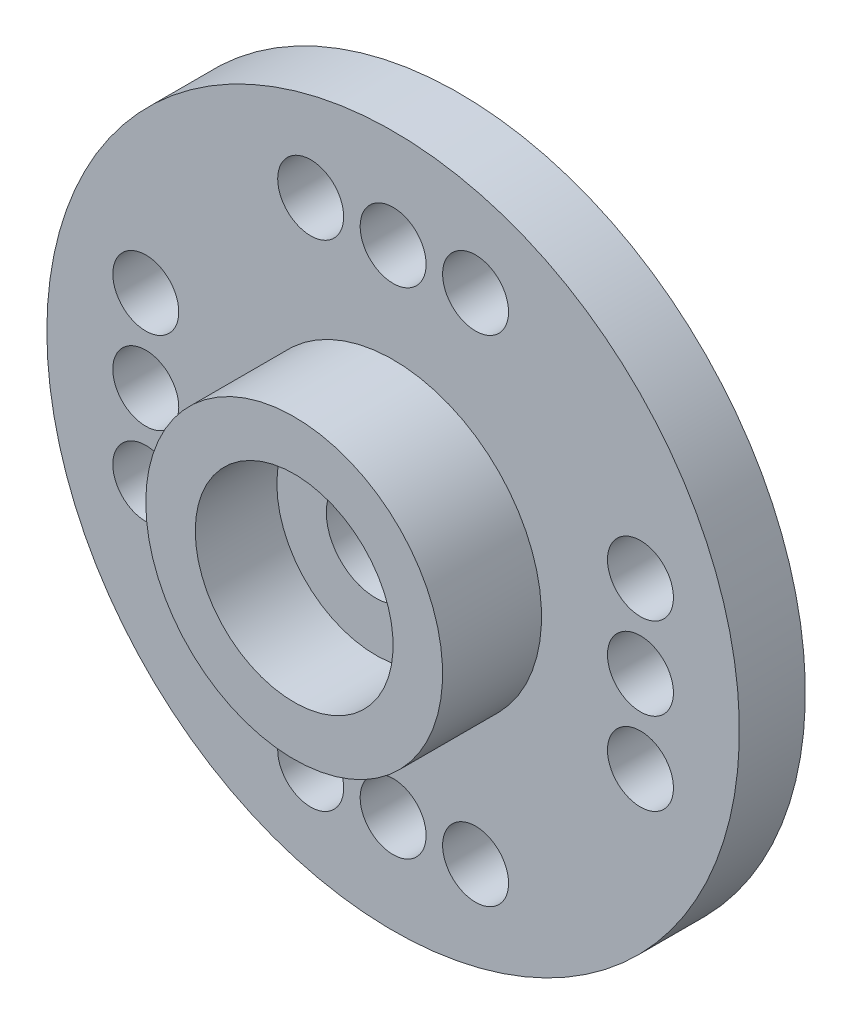
ISO-10303-21;
HEADER;
FILE_DESCRIPTION(('STEP AP214'),'2;1');
FILE_NAME('part.step','',(''),(''),'','','');
FILE_SCHEMA(('AUTOMOTIVE_DESIGN { 1 0 10303 214 1 1 1 1 }'));
ENDSEC;
DATA;
#1=APPLICATION_CONTEXT('core data for automotive mechanical design processes');
#2=APPLICATION_PROTOCOL_DEFINITION('international standard','automotive_design',2000,#1);
#3=PRODUCT_CONTEXT('',#1,'mechanical');
#4=PRODUCT('Part','Part','',(#3));
#5=PRODUCT_RELATED_PRODUCT_CATEGORY('part','',(#4));
#6=PRODUCT_DEFINITION_FORMATION('','',#4);
#7=PRODUCT_DEFINITION_CONTEXT('part definition',#1,'design');
#8=PRODUCT_DEFINITION('design','',#6,#7);
#9=PRODUCT_DEFINITION_SHAPE('','',#8);
#10=(LENGTH_UNIT() NAMED_UNIT(*) SI_UNIT(.MILLI.,.METRE.));
#11=(NAMED_UNIT(*) PLANE_ANGLE_UNIT() SI_UNIT($,.RADIAN.));
#12=(NAMED_UNIT(*) SI_UNIT($,.STERADIAN.) SOLID_ANGLE_UNIT());
#13=UNCERTAINTY_MEASURE_WITH_UNIT(LENGTH_MEASURE(1.E-05),#10,'distance_accuracy_value','');
#14=(GEOMETRIC_REPRESENTATION_CONTEXT(3) GLOBAL_UNCERTAINTY_ASSIGNED_CONTEXT((#13)) GLOBAL_UNIT_ASSIGNED_CONTEXT((#10,
#11,#12)) REPRESENTATION_CONTEXT('',''));
#15=CARTESIAN_POINT('',(0.,0.,0.));
#16=DIRECTION('',(0.,0.,1.));
#17=DIRECTION('',(1.,0.,0.));
#18=AXIS2_PLACEMENT_3D('',#15,#16,#17);
#19=CARTESIAN_POINT('',(0.,0.,0.));
#20=DIRECTION('',(0.,0.,-1.));
#21=DIRECTION('',(-1.,0.,0.));
#22=AXIS2_PLACEMENT_3D('',#19,#20,#21);
#23=CYLINDRICAL_SURFACE('',#22,1.5);
#24=CARTESIAN_POINT('',(0.,0.,0.));
#25=DIRECTION('',(0.,0.,-1.));
#26=DIRECTION('',(-1.,0.,0.));
#27=AXIS2_PLACEMENT_3D('',#24,#25,#26);
#28=CIRCLE('',#27,1.5);
#29=CARTESIAN_POINT('',(-1.5,0.,0.));
#30=VERTEX_POINT('',#29);
#31=EDGE_CURVE('E10',#30,#30,#28,.T.);
#32=ORIENTED_EDGE('',*,*,#31,.T.);
#33=EDGE_LOOP('',(#32));
#34=FACE_BOUND('',#33,.T.);
#35=CARTESIAN_POINT('',(0.,0.,1.52553869697731));
#36=DIRECTION('',(0.,0.,-1.));
#37=DIRECTION('',(-1.,0.,0.));
#38=AXIS2_PLACEMENT_3D('',#35,#36,#37);
#39=CIRCLE('',#38,1.5);
#40=CARTESIAN_POINT('',(-1.5,0.,1.52553869697731));
#41=VERTEX_POINT('',#40);
#42=EDGE_CURVE('E49',#41,#41,#39,.T.);
#43=ORIENTED_EDGE('',*,*,#42,.F.);
#44=EDGE_LOOP('',(#43));
#45=FACE_BOUND('',#44,.T.);
#46=ADVANCED_FACE('F30',(#34,#45),#23,.F.);
#47=CARTESIAN_POINT('',(0.,1.5,0.));
#48=DIRECTION('',(0.,0.,-1.));
#49=DIRECTION('',(-1.,0.,0.));
#50=AXIS2_PLACEMENT_3D('',#47,#48,#49);
#51=PLANE('',#50);
#52=CARTESIAN_POINT('',(0.,0.,0.));
#53=DIRECTION('',(0.,0.,-1.));
#54=DIRECTION('',(-1.,0.,0.));
#55=AXIS2_PLACEMENT_3D('',#52,#53,#54);
#56=CIRCLE('',#55,3.);
#57=CARTESIAN_POINT('',(-3.,0.,0.));
#58=VERTEX_POINT('',#57);
#59=EDGE_CURVE('E37',#58,#58,#56,.T.);
#60=ORIENTED_EDGE('',*,*,#59,.T.);
#61=EDGE_LOOP('',(#60));
#62=FACE_BOUND('',#61,.T.);
#63=ORIENTED_EDGE('',*,*,#31,.F.);
#64=EDGE_LOOP('',(#63));
#65=FACE_BOUND('',#64,.T.);
#66=ADVANCED_FACE('F168',(#62,#65),#51,.T.);
#67=CARTESIAN_POINT('',(0.,0.,0.));
#68=DIRECTION('',(0.,0.,-1.));
#69=DIRECTION('',(-1.,0.,0.));
#70=AXIS2_PLACEMENT_3D('',#67,#68,#69);
#71=CYLINDRICAL_SURFACE('',#70,3.);
#72=CARTESIAN_POINT('',(0.,0.,-1.5));
#73=DIRECTION('',(0.,0.,-1.));
#74=DIRECTION('',(-1.,0.,0.));
#75=AXIS2_PLACEMENT_3D('',#72,#73,#74);
#76=CIRCLE('',#75,3.);
#77=CARTESIAN_POINT('',(-3.,0.,-1.5));
#78=VERTEX_POINT('',#77);
#79=EDGE_CURVE('E42',#78,#78,#76,.T.);
#80=ORIENTED_EDGE('',*,*,#79,.T.);
#81=EDGE_LOOP('',(#80));
#82=FACE_BOUND('',#81,.T.);
#83=ORIENTED_EDGE('',*,*,#59,.F.);
#84=EDGE_LOOP('',(#83));
#85=FACE_BOUND('',#84,.T.);
#86=ADVANCED_FACE('F153',(#82,#85),#71,.F.);
#87=CARTESIAN_POINT('',(0.,3.,-1.5));
#88=DIRECTION('',(0.,0.,-1.));
#89=DIRECTION('',(-1.,0.,0.));
#90=AXIS2_PLACEMENT_3D('',#87,#88,#89);
#91=PLANE('',#90);
#92=CARTESIAN_POINT('',(0.,0.,-1.5));
#93=DIRECTION('',(0.,0.,-1.));
#94=DIRECTION('',(-1.,0.,0.));
#95=AXIS2_PLACEMENT_3D('',#92,#93,#94);
#96=CIRCLE('',#95,3.5);
#97=CARTESIAN_POINT('',(-3.5,0.,-1.5));
#98=VERTEX_POINT('',#97);
#99=EDGE_CURVE('E148',#98,#98,#96,.T.);
#100=ORIENTED_EDGE('',*,*,#99,.T.);
#101=EDGE_LOOP('',(#100));
#102=FACE_BOUND('',#101,.T.);
#103=ORIENTED_EDGE('',*,*,#79,.F.);
#104=EDGE_LOOP('',(#103));
#105=FACE_BOUND('',#104,.T.);
#106=ADVANCED_FACE('F156',(#102,#105),#91,.T.);
#107=CARTESIAN_POINT('',(0.,0.,0.));
#108=DIRECTION('',(0.,0.,-1.));
#109=DIRECTION('',(-1.,0.,0.));
#110=AXIS2_PLACEMENT_3D('',#107,#108,#109);
#111=CYLINDRICAL_SURFACE('',#110,3.5);
#112=CARTESIAN_POINT('',(0.,0.,0.5));
#113=DIRECTION('',(0.,0.,-1.));
#114=DIRECTION('',(-1.,0.,0.));
#115=AXIS2_PLACEMENT_3D('',#112,#113,#114);
#116=CIRCLE('',#115,3.5);
#117=CARTESIAN_POINT('',(-3.5,0.,0.5));
#118=VERTEX_POINT('',#117);
#119=EDGE_CURVE('E145',#118,#118,#116,.T.);
#120=ORIENTED_EDGE('',*,*,#119,.T.);
#121=EDGE_LOOP('',(#120));
#122=FACE_BOUND('',#121,.T.);
#123=ORIENTED_EDGE('',*,*,#99,.F.);
#124=EDGE_LOOP('',(#123));
#125=FACE_BOUND('',#124,.T.);
#126=ADVANCED_FACE('F158',(#122,#125),#111,.T.);
#127=CARTESIAN_POINT('',(0.,3.5,0.5));
#128=DIRECTION('',(0.,0.,-1.));
#129=DIRECTION('',(-1.,0.,0.));
#130=AXIS2_PLACEMENT_3D('',#127,#128,#129);
#131=PLANE('',#130);
#132=CARTESIAN_POINT('',(0.,0.,0.5));
#133=DIRECTION('',(0.,0.,-1.));
#134=DIRECTION('',(-1.,0.,0.));
#135=AXIS2_PLACEMENT_3D('',#132,#133,#134);
#136=CIRCLE('',#135,4.5);
#137=CARTESIAN_POINT('',(-4.5,0.,0.5));
#138=VERTEX_POINT('',#137);
#139=EDGE_CURVE('E142',#138,#138,#136,.T.);
#140=ORIENTED_EDGE('',*,*,#139,.T.);
#141=EDGE_LOOP('',(#140));
#142=FACE_BOUND('',#141,.T.);
#143=ORIENTED_EDGE('',*,*,#119,.F.);
#144=EDGE_LOOP('',(#143));
#145=FACE_BOUND('',#144,.T.);
#146=ADVANCED_FACE('F165',(#142,#145),#131,.T.);
#147=CARTESIAN_POINT('',(0.,0.,0.));
#148=DIRECTION('',(0.,0.,-1.));
#149=DIRECTION('',(-1.,0.,0.));
#150=AXIS2_PLACEMENT_3D('',#147,#148,#149);
#151=CYLINDRICAL_SURFACE('',#150,4.5);
#152=CARTESIAN_POINT('',(0.,0.,-1.));
#153=DIRECTION('',(0.,0.,-1.));
#154=DIRECTION('',(-1.,0.,0.));
#155=AXIS2_PLACEMENT_3D('',#152,#153,#154);
#156=CIRCLE('',#155,4.5);
#157=CARTESIAN_POINT('',(-4.5,0.,-1.));
#158=VERTEX_POINT('',#157);
#159=EDGE_CURVE('E139',#158,#158,#156,.T.);
#160=ORIENTED_EDGE('',*,*,#159,.T.);
#161=EDGE_LOOP('',(#160));
#162=FACE_BOUND('',#161,.T.);
#163=ORIENTED_EDGE('',*,*,#139,.F.);
#164=EDGE_LOOP('',(#163));
#165=FACE_BOUND('',#164,.T.);
#166=ADVANCED_FACE('F219',(#162,#165),#151,.F.);
#167=CARTESIAN_POINT('',(0.,4.5,-1.));
#168=DIRECTION('',(0.,0.,-1.));
#169=DIRECTION('',(-1.,0.,0.));
#170=AXIS2_PLACEMENT_3D('',#167,#168,#169);
#171=PLANE('',#170);
#172=CARTESIAN_POINT('',(-2.50000000000008,7.49999999999997,-1.));
#173=DIRECTION('',(0.,0.,-1.));
#174=DIRECTION('',(-1.,0.,0.));
#175=AXIS2_PLACEMENT_3D('',#172,#173,#174);
#176=CIRCLE('',#175,1.);
#177=CARTESIAN_POINT('',(-3.50000000000008,7.49999999999997,-1.));
#178=VERTEX_POINT('',#177);
#179=EDGE_CURVE('E98',#178,#178,#176,.T.);
#180=ORIENTED_EDGE('',*,*,#179,.F.);
#181=EDGE_LOOP('',(#180));
#182=FACE_BOUND('',#181,.T.);
#183=CARTESIAN_POINT('',(7.49999999999998,2.50000000000005,-1.));
#184=DIRECTION('',(0.,0.,-1.));
#185=DIRECTION('',(-1.,0.,0.));
#186=AXIS2_PLACEMENT_3D('',#183,#184,#185);
#187=CIRCLE('',#186,1.);
#188=CARTESIAN_POINT('',(6.49999999999998,2.50000000000005,-1.));
#189=VERTEX_POINT('',#188);
#190=EDGE_CURVE('E88',#189,#189,#187,.T.);
#191=ORIENTED_EDGE('',*,*,#190,.F.);
#192=EDGE_LOOP('',(#191));
#193=FACE_BOUND('',#192,.T.);
#194=CARTESIAN_POINT('',(2.50000000000003,-7.49999999999999,-1.));
#195=DIRECTION('',(0.,0.,-1.));
#196=DIRECTION('',(-1.,0.,0.));
#197=AXIS2_PLACEMENT_3D('',#194,#195,#196);
#198=CIRCLE('',#197,1.);
#199=CARTESIAN_POINT('',(1.50000000000003,-7.49999999999999,-1.));
#200=VERTEX_POINT('',#199);
#201=EDGE_CURVE('E85',#200,#200,#198,.T.);
#202=ORIENTED_EDGE('',*,*,#201,.F.);
#203=EDGE_LOOP('',(#202));
#204=FACE_BOUND('',#203,.T.);
#205=CARTESIAN_POINT('',(2.50000000000014,7.49999999999972,-1.));
#206=DIRECTION('',(0.,0.,-1.));
#207=DIRECTION('',(-1.,0.,0.));
#208=AXIS2_PLACEMENT_3D('',#205,#206,#207);
#209=CIRCLE('',#208,1.);
#210=CARTESIAN_POINT('',(1.50000000000014,7.49999999999972,-1.));
#211=VERTEX_POINT('',#210);
#212=EDGE_CURVE('E82',#211,#211,#209,.T.);
#213=ORIENTED_EDGE('',*,*,#212,.F.);
#214=EDGE_LOOP('',(#213));
#215=FACE_BOUND('',#214,.T.);
#216=CARTESIAN_POINT('',(7.49999999999986,-2.50000000000042,-1.));
#217=DIRECTION('',(0.,0.,-1.));
#218=DIRECTION('',(-1.,0.,0.));
#219=AXIS2_PLACEMENT_3D('',#216,#217,#218);
#220=CIRCLE('',#219,1.);
#221=CARTESIAN_POINT('',(6.49999999999986,-2.50000000000042,-1.));
#222=VERTEX_POINT('',#221);
#223=EDGE_CURVE('E78',#222,#222,#220,.T.);
#224=ORIENTED_EDGE('',*,*,#223,.F.);
#225=EDGE_LOOP('',(#224));
#226=FACE_BOUND('',#225,.T.);
#227=CARTESIAN_POINT('',(-2.50000000000028,-7.50000000000014,-1.));
#228=DIRECTION('',(0.,0.,-1.));
#229=DIRECTION('',(-1.,0.,0.));
#230=AXIS2_PLACEMENT_3D('',#227,#228,#229);
#231=CIRCLE('',#230,1.);
#232=CARTESIAN_POINT('',(-3.50000000000028,-7.50000000000014,-1.));
#233=VERTEX_POINT('',#232);
#234=EDGE_CURVE('E74',#233,#233,#231,.T.);
#235=ORIENTED_EDGE('',*,*,#234,.F.);
#236=EDGE_LOOP('',(#235));
#237=FACE_BOUND('',#236,.T.);
#238=CARTESIAN_POINT('',(0.,-7.5,-1.));
#239=DIRECTION('',(0.,0.,-1.));
#240=DIRECTION('',(-1.,0.,0.));
#241=AXIS2_PLACEMENT_3D('',#238,#239,#240);
#242=CIRCLE('',#241,1.);
#243=CARTESIAN_POINT('',(-1.,-7.5,-1.));
#244=VERTEX_POINT('',#243);
#245=EDGE_CURVE('E70',#244,#244,#242,.T.);
#246=ORIENTED_EDGE('',*,*,#245,.F.);
#247=EDGE_LOOP('',(#246));
#248=FACE_BOUND('',#247,.T.);
#249=CARTESIAN_POINT('',(7.5,0.,-1.));
#250=DIRECTION('',(0.,0.,-1.));
#251=DIRECTION('',(-1.,0.,0.));
#252=AXIS2_PLACEMENT_3D('',#249,#250,#251);
#253=CIRCLE('',#252,1.);
#254=CARTESIAN_POINT('',(6.5,0.,-1.));
#255=VERTEX_POINT('',#254);
#256=EDGE_CURVE('E66',#255,#255,#253,.T.);
#257=ORIENTED_EDGE('',*,*,#256,.F.);
#258=EDGE_LOOP('',(#257));
#259=FACE_BOUND('',#258,.T.);
#260=CARTESIAN_POINT('',(-7.5,0.,-1.));
#261=DIRECTION('',(0.,0.,-1.));
#262=DIRECTION('',(-1.,0.,0.));
#263=AXIS2_PLACEMENT_3D('',#260,#261,#262);
#264=CIRCLE('',#263,1.);
#265=CARTESIAN_POINT('',(-8.5,0.,-1.));
#266=VERTEX_POINT('',#265);
#267=EDGE_CURVE('E62',#266,#266,#264,.T.);
#268=ORIENTED_EDGE('',*,*,#267,.F.);
#269=EDGE_LOOP('',(#268));
#270=FACE_BOUND('',#269,.T.);
#271=CARTESIAN_POINT('',(0.,7.5,-1.));
#272=DIRECTION('',(0.,0.,-1.));
#273=DIRECTION('',(-1.,0.,0.));
#274=AXIS2_PLACEMENT_3D('',#271,#272,#273);
#275=CIRCLE('',#274,1.);
#276=CARTESIAN_POINT('',(-1.,7.5,-1.));
#277=VERTEX_POINT('',#276);
#278=EDGE_CURVE('E58',#277,#277,#275,.T.);
#279=ORIENTED_EDGE('',*,*,#278,.F.);
#280=EDGE_LOOP('',(#279));
#281=FACE_BOUND('',#280,.T.);
#282=CARTESIAN_POINT('',(-7.5,-2.5,-1.));
#283=DIRECTION('',(0.,0.,-1.));
#284=DIRECTION('',(-1.,0.,0.));
#285=AXIS2_PLACEMENT_3D('',#282,#283,#284);
#286=CIRCLE('',#285,1.);
#287=CARTESIAN_POINT('',(-8.5,-2.5,-1.));
#288=VERTEX_POINT('',#287);
#289=EDGE_CURVE('E54',#288,#288,#286,.T.);
#290=ORIENTED_EDGE('',*,*,#289,.F.);
#291=EDGE_LOOP('',(#290));
#292=FACE_BOUND('',#291,.T.);
#293=CARTESIAN_POINT('',(-7.5,2.5,-1.));
#294=DIRECTION('',(0.,0.,-1.));
#295=DIRECTION('',(-1.,0.,0.));
#296=AXIS2_PLACEMENT_3D('',#293,#294,#295);
#297=CIRCLE('',#296,1.);
#298=CARTESIAN_POINT('',(-8.5,2.5,-1.));
#299=VERTEX_POINT('',#298);
#300=EDGE_CURVE('E50',#299,#299,#297,.T.);
#301=ORIENTED_EDGE('',*,*,#300,.F.);
#302=EDGE_LOOP('',(#301));
#303=FACE_BOUND('',#302,.T.);
#304=CARTESIAN_POINT('',(0.,0.,-1.));
#305=DIRECTION('',(0.,0.,-1.));
#306=DIRECTION('',(-1.,0.,0.));
#307=AXIS2_PLACEMENT_3D('',#304,#305,#306);
#308=CIRCLE('',#307,10.5);
#309=CARTESIAN_POINT('',(-10.5,0.,-1.));
#310=VERTEX_POINT('',#309);
#311=EDGE_CURVE('E136',#310,#310,#308,.T.);
#312=ORIENTED_EDGE('',*,*,#311,.T.);
#313=EDGE_LOOP('',(#312));
#314=FACE_BOUND('',#313,.T.);
#315=ORIENTED_EDGE('',*,*,#159,.F.);
#316=EDGE_LOOP('',(#315));
#317=FACE_BOUND('',#316,.T.);
#318=ADVANCED_FACE('F213',(#182,#193,#204,#215,#226,#237,#248,#259,#270,#281,#292,#303,#314,
#317),#171,.T.);
#319=CARTESIAN_POINT('',(0.,0.,0.));
#320=DIRECTION('',(0.,0.,-1.));
#321=DIRECTION('',(-1.,0.,0.));
#322=AXIS2_PLACEMENT_3D('',#319,#320,#321);
#323=CYLINDRICAL_SURFACE('',#322,10.5);
#324=CARTESIAN_POINT('',(0.,0.,1.));
#325=DIRECTION('',(0.,0.,-1.));
#326=DIRECTION('',(-1.,0.,0.));
#327=AXIS2_PLACEMENT_3D('',#324,#325,#326);
#328=CIRCLE('',#327,10.5);
#329=CARTESIAN_POINT('',(-10.5,0.,1.));
#330=VERTEX_POINT('',#329);
#331=EDGE_CURVE('E133',#330,#330,#328,.T.);
#332=ORIENTED_EDGE('',*,*,#331,.T.);
#333=EDGE_LOOP('',(#332));
#334=FACE_BOUND('',#333,.T.);
#335=ORIENTED_EDGE('',*,*,#311,.F.);
#336=EDGE_LOOP('',(#335));
#337=FACE_BOUND('',#336,.T.);
#338=ADVANCED_FACE('F206',(#334,#337),#323,.T.);
#339=CARTESIAN_POINT('',(0.,10.5,1.));
#340=DIRECTION('',(0.,0.,1.));
#341=DIRECTION('',(1.,0.,0.));
#342=AXIS2_PLACEMENT_3D('',#339,#340,#341);
#343=PLANE('',#342);
#344=CARTESIAN_POINT('',(-2.50000000000008,7.49999999999997,1.));
#345=DIRECTION('',(0.,0.,1.));
#346=DIRECTION('',(1.,0.,0.));
#347=AXIS2_PLACEMENT_3D('',#344,#345,#346);
#348=CIRCLE('',#347,1.);
#349=CARTESIAN_POINT('',(-1.50000000000008,7.49999999999997,1.));
#350=VERTEX_POINT('',#349);
#351=EDGE_CURVE('E33',#350,#350,#348,.T.);
#352=ORIENTED_EDGE('',*,*,#351,.F.);
#353=EDGE_LOOP('',(#352));
#354=FACE_BOUND('',#353,.T.);
#355=CARTESIAN_POINT('',(7.49999999999998,2.50000000000005,1.));
#356=DIRECTION('',(0.,0.,1.));
#357=DIRECTION('',(1.,0.,0.));
#358=AXIS2_PLACEMENT_3D('',#355,#356,#357);
#359=CIRCLE('',#358,1.);
#360=CARTESIAN_POINT('',(8.49999999999998,2.50000000000005,1.));
#361=VERTEX_POINT('',#360);
#362=EDGE_CURVE('E86',#361,#361,#359,.T.);
#363=ORIENTED_EDGE('',*,*,#362,.F.);
#364=EDGE_LOOP('',(#363));
#365=FACE_BOUND('',#364,.T.);
#366=CARTESIAN_POINT('',(2.50000000000003,-7.49999999999999,1.));
#367=DIRECTION('',(0.,0.,1.));
#368=DIRECTION('',(1.,0.,0.));
#369=AXIS2_PLACEMENT_3D('',#366,#367,#368);
#370=CIRCLE('',#369,1.);
#371=CARTESIAN_POINT('',(3.50000000000003,-7.49999999999999,1.));
#372=VERTEX_POINT('',#371);
#373=EDGE_CURVE('E83',#372,#372,#370,.T.);
#374=ORIENTED_EDGE('',*,*,#373,.F.);
#375=EDGE_LOOP('',(#374));
#376=FACE_BOUND('',#375,.T.);
#377=CARTESIAN_POINT('',(2.50000000000014,7.49999999999972,1.));
#378=DIRECTION('',(0.,0.,1.));
#379=DIRECTION('',(1.,0.,0.));
#380=AXIS2_PLACEMENT_3D('',#377,#378,#379);
#381=CIRCLE('',#380,1.);
#382=CARTESIAN_POINT('',(3.50000000000014,7.49999999999972,1.));
#383=VERTEX_POINT('',#382);
#384=EDGE_CURVE('E79',#383,#383,#381,.T.);
#385=ORIENTED_EDGE('',*,*,#384,.F.);
#386=EDGE_LOOP('',(#385));
#387=FACE_BOUND('',#386,.T.);
#388=CARTESIAN_POINT('',(7.49999999999986,-2.50000000000042,1.));
#389=DIRECTION('',(0.,0.,1.));
#390=DIRECTION('',(1.,0.,0.));
#391=AXIS2_PLACEMENT_3D('',#388,#389,#390);
#392=CIRCLE('',#391,1.);
#393=CARTESIAN_POINT('',(8.49999999999986,-2.50000000000042,1.));
#394=VERTEX_POINT('',#393);
#395=EDGE_CURVE('E75',#394,#394,#392,.T.);
#396=ORIENTED_EDGE('',*,*,#395,.F.);
#397=EDGE_LOOP('',(#396));
#398=FACE_BOUND('',#397,.T.);
#399=CARTESIAN_POINT('',(-2.50000000000028,-7.50000000000014,1.));
#400=DIRECTION('',(0.,0.,1.));
#401=DIRECTION('',(1.,0.,0.));
#402=AXIS2_PLACEMENT_3D('',#399,#400,#401);
#403=CIRCLE('',#402,1.);
#404=CARTESIAN_POINT('',(-1.50000000000028,-7.50000000000014,1.));
#405=VERTEX_POINT('',#404);
#406=EDGE_CURVE('E71',#405,#405,#403,.T.);
#407=ORIENTED_EDGE('',*,*,#406,.F.);
#408=EDGE_LOOP('',(#407));
#409=FACE_BOUND('',#408,.T.);
#410=CARTESIAN_POINT('',(0.,-7.5,1.));
#411=DIRECTION('',(0.,0.,1.));
#412=DIRECTION('',(1.,0.,0.));
#413=AXIS2_PLACEMENT_3D('',#410,#411,#412);
#414=CIRCLE('',#413,1.);
#415=CARTESIAN_POINT('',(1.,-7.5,1.));
#416=VERTEX_POINT('',#415);
#417=EDGE_CURVE('E67',#416,#416,#414,.T.);
#418=ORIENTED_EDGE('',*,*,#417,.F.);
#419=EDGE_LOOP('',(#418));
#420=FACE_BOUND('',#419,.T.);
#421=CARTESIAN_POINT('',(7.5,0.,1.));
#422=DIRECTION('',(0.,0.,1.));
#423=DIRECTION('',(1.,0.,0.));
#424=AXIS2_PLACEMENT_3D('',#421,#422,#423);
#425=CIRCLE('',#424,1.);
#426=CARTESIAN_POINT('',(8.5,0.,1.));
#427=VERTEX_POINT('',#426);
#428=EDGE_CURVE('E63',#427,#427,#425,.T.);
#429=ORIENTED_EDGE('',*,*,#428,.F.);
#430=EDGE_LOOP('',(#429));
#431=FACE_BOUND('',#430,.T.);
#432=CARTESIAN_POINT('',(-7.5,0.,1.));
#433=DIRECTION('',(0.,0.,1.));
#434=DIRECTION('',(1.,0.,0.));
#435=AXIS2_PLACEMENT_3D('',#432,#433,#434);
#436=CIRCLE('',#435,1.);
#437=CARTESIAN_POINT('',(-6.5,0.,1.));
#438=VERTEX_POINT('',#437);
#439=EDGE_CURVE('E59',#438,#438,#436,.T.);
#440=ORIENTED_EDGE('',*,*,#439,.F.);
#441=EDGE_LOOP('',(#440));
#442=FACE_BOUND('',#441,.T.);
#443=CARTESIAN_POINT('',(0.,7.5,1.));
#444=DIRECTION('',(0.,0.,1.));
#445=DIRECTION('',(1.,0.,0.));
#446=AXIS2_PLACEMENT_3D('',#443,#444,#445);
#447=CIRCLE('',#446,1.);
#448=CARTESIAN_POINT('',(1.,7.5,1.));
#449=VERTEX_POINT('',#448);
#450=EDGE_CURVE('E55',#449,#449,#447,.T.);
#451=ORIENTED_EDGE('',*,*,#450,.F.);
#452=EDGE_LOOP('',(#451));
#453=FACE_BOUND('',#452,.T.);
#454=CARTESIAN_POINT('',(-7.5,-2.5,1.));
#455=DIRECTION('',(0.,0.,1.));
#456=DIRECTION('',(1.,0.,0.));
#457=AXIS2_PLACEMENT_3D('',#454,#455,#456);
#458=CIRCLE('',#457,1.);
#459=CARTESIAN_POINT('',(-6.5,-2.5,1.));
#460=VERTEX_POINT('',#459);
#461=EDGE_CURVE('E51',#460,#460,#458,.T.);
#462=ORIENTED_EDGE('',*,*,#461,.F.);
#463=EDGE_LOOP('',(#462));
#464=FACE_BOUND('',#463,.T.);
#465=CARTESIAN_POINT('',(-7.5,2.5,1.));
#466=DIRECTION('',(0.,0.,1.));
#467=DIRECTION('',(1.,0.,0.));
#468=AXIS2_PLACEMENT_3D('',#465,#466,#467);
#469=CIRCLE('',#468,1.);
#470=CARTESIAN_POINT('',(-6.5,2.5,1.));
#471=VERTEX_POINT('',#470);
#472=EDGE_CURVE('E46',#471,#471,#469,.T.);
#473=ORIENTED_EDGE('',*,*,#472,.F.);
#474=EDGE_LOOP('',(#473));
#475=FACE_BOUND('',#474,.T.);
#476=CARTESIAN_POINT('',(0.,0.,0.999999999999999));
#477=DIRECTION('',(0.,0.,-1.));
#478=DIRECTION('',(-1.,0.,0.));
#479=AXIS2_PLACEMENT_3D('',#476,#477,#478);
#480=CIRCLE('',#479,4.5);
#481=CARTESIAN_POINT('',(-4.5,0.,0.999999999999999));
#482=VERTEX_POINT('',#481);
#483=EDGE_CURVE('E130',#482,#482,#480,.T.);
#484=ORIENTED_EDGE('',*,*,#483,.T.);
#485=EDGE_LOOP('',(#484));
#486=FACE_BOUND('',#485,.T.);
#487=ORIENTED_EDGE('',*,*,#331,.F.);
#488=EDGE_LOOP('',(#487));
#489=FACE_BOUND('',#488,.T.);
#490=ADVANCED_FACE('F200',(#354,#365,#376,#387,#398,#409,#420,#431,#442,#453,#464,#475,#486,
#489),#343,.T.);
#491=CARTESIAN_POINT('',(0.,0.,0.));
#492=DIRECTION('',(0.,0.,-1.));
#493=DIRECTION('',(-1.,0.,0.));
#494=AXIS2_PLACEMENT_3D('',#491,#492,#493);
#495=CYLINDRICAL_SURFACE('',#494,4.5);
#496=CARTESIAN_POINT('',(0.,0.,4.));
#497=DIRECTION('',(0.,0.,-1.));
#498=DIRECTION('',(-1.,0.,0.));
#499=AXIS2_PLACEMENT_3D('',#496,#497,#498);
#500=CIRCLE('',#499,4.5);
#501=CARTESIAN_POINT('',(-4.5,0.,4.));
#502=VERTEX_POINT('',#501);
#503=EDGE_CURVE('E127',#502,#502,#500,.T.);
#504=ORIENTED_EDGE('',*,*,#503,.T.);
#505=EDGE_LOOP('',(#504));
#506=FACE_BOUND('',#505,.T.);
#507=ORIENTED_EDGE('',*,*,#483,.F.);
#508=EDGE_LOOP('',(#507));
#509=FACE_BOUND('',#508,.T.);
#510=ADVANCED_FACE('F194',(#506,#509),#495,.T.);
#511=CARTESIAN_POINT('',(0.,4.5,4.));
#512=DIRECTION('',(0.,0.,1.));
#513=DIRECTION('',(1.,0.,0.));
#514=AXIS2_PLACEMENT_3D('',#511,#512,#513);
#515=PLANE('',#514);
#516=CARTESIAN_POINT('',(0.,0.,4.));
#517=DIRECTION('',(0.,0.,-1.));
#518=DIRECTION('',(-1.,0.,0.));
#519=AXIS2_PLACEMENT_3D('',#516,#517,#518);
#520=CIRCLE('',#519,3.);
#521=CARTESIAN_POINT('',(-3.,0.,4.));
#522=VERTEX_POINT('',#521);
#523=EDGE_CURVE('E124',#522,#522,#520,.T.);
#524=ORIENTED_EDGE('',*,*,#523,.T.);
#525=EDGE_LOOP('',(#524));
#526=FACE_BOUND('',#525,.T.);
#527=ORIENTED_EDGE('',*,*,#503,.F.);
#528=EDGE_LOOP('',(#527));
#529=FACE_BOUND('',#528,.T.);
#530=ADVANCED_FACE('F188',(#526,#529),#515,.T.);
#531=CARTESIAN_POINT('',(0.,0.,0.));
#532=DIRECTION('',(0.,0.,-1.));
#533=DIRECTION('',(-1.,0.,0.));
#534=AXIS2_PLACEMENT_3D('',#531,#532,#533);
#535=CYLINDRICAL_SURFACE('',#534,3.);
#536=CARTESIAN_POINT('',(0.,0.,1.52553869697731));
#537=DIRECTION('',(0.,0.,-1.));
#538=DIRECTION('',(-1.,0.,0.));
#539=AXIS2_PLACEMENT_3D('',#536,#537,#538);
#540=CIRCLE('',#539,3.);
#541=CARTESIAN_POINT('',(-3.,0.,1.52553869697731));
#542=VERTEX_POINT('',#541);
#543=EDGE_CURVE('E121',#542,#542,#540,.T.);
#544=ORIENTED_EDGE('',*,*,#543,.T.);
#545=EDGE_LOOP('',(#544));
#546=FACE_BOUND('',#545,.T.);
#547=ORIENTED_EDGE('',*,*,#523,.F.);
#548=EDGE_LOOP('',(#547));
#549=FACE_BOUND('',#548,.T.);
#550=ADVANCED_FACE('F182',(#546,#549),#535,.F.);
#551=CARTESIAN_POINT('',(0.,3.,1.52553869697731));
#552=DIRECTION('',(0.,0.,1.));
#553=DIRECTION('',(1.,0.,0.));
#554=AXIS2_PLACEMENT_3D('',#551,#552,#553);
#555=PLANE('',#554);
#556=ORIENTED_EDGE('',*,*,#42,.T.);
#557=EDGE_LOOP('',(#556));
#558=FACE_BOUND('',#557,.T.);
#559=ORIENTED_EDGE('',*,*,#543,.F.);
#560=EDGE_LOOP('',(#559));
#561=FACE_BOUND('',#560,.T.);
#562=ADVANCED_FACE('F178',(#558,#561),#555,.T.);
#563=CARTESIAN_POINT('',(-7.5,2.5,2.));
#564=DIRECTION('',(0.,0.,-1.));
#565=DIRECTION('',(-1.,0.,0.));
#566=AXIS2_PLACEMENT_3D('',#563,#564,#565);
#567=CYLINDRICAL_SURFACE('',#566,1.);
#568=ORIENTED_EDGE('',*,*,#472,.T.);
#569=EDGE_LOOP('',(#568));
#570=FACE_BOUND('',#569,.T.);
#571=ORIENTED_EDGE('',*,*,#300,.T.);
#572=EDGE_LOOP('',(#571));
#573=FACE_BOUND('',#572,.T.);
#574=ADVANCED_FACE('F181',(#570,#573),#567,.F.);
#575=CARTESIAN_POINT('',(-7.5,-2.5,2.));
#576=DIRECTION('',(0.,0.,-1.));
#577=DIRECTION('',(-1.,0.,0.));
#578=AXIS2_PLACEMENT_3D('',#575,#576,#577);
#579=CYLINDRICAL_SURFACE('',#578,1.);
#580=ORIENTED_EDGE('',*,*,#461,.T.);
#581=EDGE_LOOP('',(#580));
#582=FACE_BOUND('',#581,.T.);
#583=ORIENTED_EDGE('',*,*,#289,.T.);
#584=EDGE_LOOP('',(#583));
#585=FACE_BOUND('',#584,.T.);
#586=ADVANCED_FACE('F240',(#582,#585),#579,.F.);
#587=CARTESIAN_POINT('',(0.,7.5,2.));
#588=DIRECTION('',(0.,0.,-1.));
#589=DIRECTION('',(-1.,0.,0.));
#590=AXIS2_PLACEMENT_3D('',#587,#588,#589);
#591=CYLINDRICAL_SURFACE('',#590,1.);
#592=ORIENTED_EDGE('',*,*,#450,.T.);
#593=EDGE_LOOP('',(#592));
#594=FACE_BOUND('',#593,.T.);
#595=ORIENTED_EDGE('',*,*,#278,.T.);
#596=EDGE_LOOP('',(#595));
#597=FACE_BOUND('',#596,.T.);
#598=ADVANCED_FACE('F244',(#594,#597),#591,.F.);
#599=CARTESIAN_POINT('',(-7.5,0.,2.));
#600=DIRECTION('',(0.,0.,-1.));
#601=DIRECTION('',(-1.,0.,0.));
#602=AXIS2_PLACEMENT_3D('',#599,#600,#601);
#603=CYLINDRICAL_SURFACE('',#602,1.);
#604=ORIENTED_EDGE('',*,*,#439,.T.);
#605=EDGE_LOOP('',(#604));
#606=FACE_BOUND('',#605,.T.);
#607=ORIENTED_EDGE('',*,*,#267,.T.);
#608=EDGE_LOOP('',(#607));
#609=FACE_BOUND('',#608,.T.);
#610=ADVANCED_FACE('F248',(#606,#609),#603,.F.);
#611=CARTESIAN_POINT('',(7.5,0.,2.));
#612=DIRECTION('',(0.,0.,-1.));
#613=DIRECTION('',(-1.,0.,0.));
#614=AXIS2_PLACEMENT_3D('',#611,#612,#613);
#615=CYLINDRICAL_SURFACE('',#614,1.);
#616=ORIENTED_EDGE('',*,*,#428,.T.);
#617=EDGE_LOOP('',(#616));
#618=FACE_BOUND('',#617,.T.);
#619=ORIENTED_EDGE('',*,*,#256,.T.);
#620=EDGE_LOOP('',(#619));
#621=FACE_BOUND('',#620,.T.);
#622=ADVANCED_FACE('F252',(#618,#621),#615,.F.);
#623=CARTESIAN_POINT('',(0.,-7.5,2.));
#624=DIRECTION('',(0.,0.,-1.));
#625=DIRECTION('',(-1.,0.,0.));
#626=AXIS2_PLACEMENT_3D('',#623,#624,#625);
#627=CYLINDRICAL_SURFACE('',#626,1.);
#628=ORIENTED_EDGE('',*,*,#417,.T.);
#629=EDGE_LOOP('',(#628));
#630=FACE_BOUND('',#629,.T.);
#631=ORIENTED_EDGE('',*,*,#245,.T.);
#632=EDGE_LOOP('',(#631));
#633=FACE_BOUND('',#632,.T.);
#634=ADVANCED_FACE('F256',(#630,#633),#627,.F.);
#635=CARTESIAN_POINT('',(-2.50000000000028,-7.50000000000014,2.));
#636=DIRECTION('',(0.,0.,-1.));
#637=DIRECTION('',(-1.,0.,0.));
#638=AXIS2_PLACEMENT_3D('',#635,#636,#637);
#639=CYLINDRICAL_SURFACE('',#638,1.);
#640=ORIENTED_EDGE('',*,*,#406,.T.);
#641=EDGE_LOOP('',(#640));
#642=FACE_BOUND('',#641,.T.);
#643=ORIENTED_EDGE('',*,*,#234,.T.);
#644=EDGE_LOOP('',(#643));
#645=FACE_BOUND('',#644,.T.);
#646=ADVANCED_FACE('F260',(#642,#645),#639,.F.);
#647=CARTESIAN_POINT('',(7.49999999999986,-2.50000000000042,2.));
#648=DIRECTION('',(0.,0.,-1.));
#649=DIRECTION('',(-1.,0.,0.));
#650=AXIS2_PLACEMENT_3D('',#647,#648,#649);
#651=CYLINDRICAL_SURFACE('',#650,1.);
#652=ORIENTED_EDGE('',*,*,#395,.T.);
#653=EDGE_LOOP('',(#652));
#654=FACE_BOUND('',#653,.T.);
#655=ORIENTED_EDGE('',*,*,#223,.T.);
#656=EDGE_LOOP('',(#655));
#657=FACE_BOUND('',#656,.T.);
#658=ADVANCED_FACE('F264',(#654,#657),#651,.F.);
#659=CARTESIAN_POINT('',(2.50000000000014,7.49999999999972,2.));
#660=DIRECTION('',(0.,0.,-1.));
#661=DIRECTION('',(-1.,0.,0.));
#662=AXIS2_PLACEMENT_3D('',#659,#660,#661);
#663=CYLINDRICAL_SURFACE('',#662,1.);
#664=ORIENTED_EDGE('',*,*,#384,.T.);
#665=EDGE_LOOP('',(#664));
#666=FACE_BOUND('',#665,.T.);
#667=ORIENTED_EDGE('',*,*,#212,.T.);
#668=EDGE_LOOP('',(#667));
#669=FACE_BOUND('',#668,.T.);
#670=ADVANCED_FACE('F268',(#666,#669),#663,.F.);
#671=CARTESIAN_POINT('',(2.50000000000003,-7.49999999999999,2.));
#672=DIRECTION('',(0.,0.,-1.));
#673=DIRECTION('',(-1.,0.,0.));
#674=AXIS2_PLACEMENT_3D('',#671,#672,#673);
#675=CYLINDRICAL_SURFACE('',#674,1.);
#676=ORIENTED_EDGE('',*,*,#373,.T.);
#677=EDGE_LOOP('',(#676));
#678=FACE_BOUND('',#677,.T.);
#679=ORIENTED_EDGE('',*,*,#201,.T.);
#680=EDGE_LOOP('',(#679));
#681=FACE_BOUND('',#680,.T.);
#682=ADVANCED_FACE('F272',(#678,#681),#675,.F.);
#683=CARTESIAN_POINT('',(7.49999999999998,2.50000000000005,2.));
#684=DIRECTION('',(0.,0.,-1.));
#685=DIRECTION('',(-1.,0.,0.));
#686=AXIS2_PLACEMENT_3D('',#683,#684,#685);
#687=CYLINDRICAL_SURFACE('',#686,1.);
#688=ORIENTED_EDGE('',*,*,#362,.T.);
#689=EDGE_LOOP('',(#688));
#690=FACE_BOUND('',#689,.T.);
#691=ORIENTED_EDGE('',*,*,#190,.T.);
#692=EDGE_LOOP('',(#691));
#693=FACE_BOUND('',#692,.T.);
#694=ADVANCED_FACE('F276',(#690,#693),#687,.F.);
#695=CARTESIAN_POINT('',(-2.50000000000008,7.49999999999997,2.));
#696=DIRECTION('',(0.,0.,-1.));
#697=DIRECTION('',(-1.,0.,0.));
#698=AXIS2_PLACEMENT_3D('',#695,#696,#697);
#699=CYLINDRICAL_SURFACE('',#698,1.);
#700=ORIENTED_EDGE('',*,*,#351,.T.);
#701=EDGE_LOOP('',(#700));
#702=FACE_BOUND('',#701,.T.);
#703=ORIENTED_EDGE('',*,*,#179,.T.);
#704=EDGE_LOOP('',(#703));
#705=FACE_BOUND('',#704,.T.);
#706=ADVANCED_FACE('F280',(#702,#705),#699,.F.);
#707=CLOSED_SHELL('',(#46,#66,#86,#106,#126,#146,#166,#318,#338,#490,#510,#530,#550,#562,#574,
#586,#598,#610,#622,#634,#646,#658,#670,#682,#694,#706));
#708=MANIFOLD_SOLID_BREP('B2',#707);
#709=ADVANCED_BREP_SHAPE_REPRESENTATION('',(#18,#708),#14);
#710=SHAPE_DEFINITION_REPRESENTATION(#9,#709);
ENDSEC;
END-ISO-10303-21;
